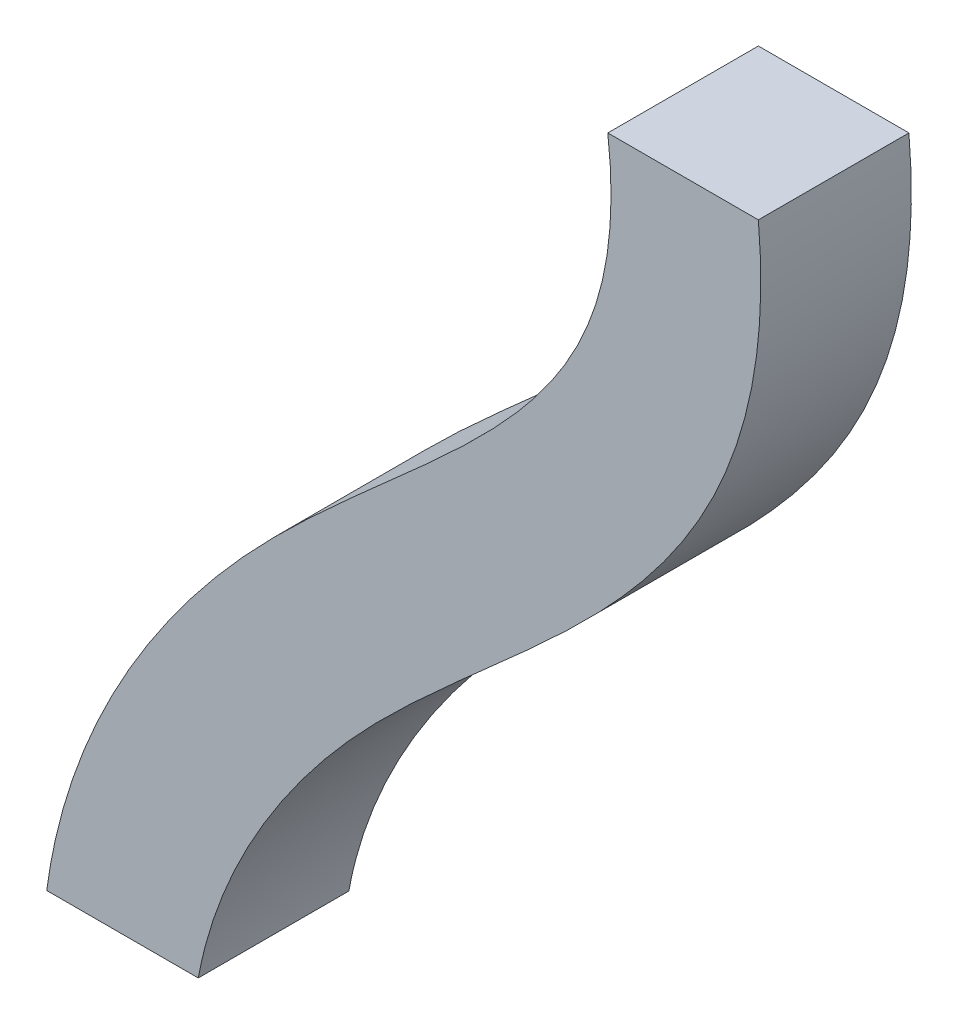
ISO-10303-21;
HEADER;
FILE_DESCRIPTION(('STEP AP214'),'2;1');
FILE_NAME('part.step','',(''),(''),'','','');
FILE_SCHEMA(('AUTOMOTIVE_DESIGN { 1 0 10303 214 1 1 1 1 }'));
ENDSEC;
DATA;
#1=APPLICATION_CONTEXT('core data for automotive mechanical design processes');
#2=APPLICATION_PROTOCOL_DEFINITION('international standard','automotive_design',2000,#1);
#3=PRODUCT_CONTEXT('',#1,'mechanical');
#4=PRODUCT('Part','Part','',(#3));
#5=PRODUCT_RELATED_PRODUCT_CATEGORY('part','',(#4));
#6=PRODUCT_DEFINITION_FORMATION('','',#4);
#7=PRODUCT_DEFINITION_CONTEXT('part definition',#1,'design');
#8=PRODUCT_DEFINITION('design','',#6,#7);
#9=PRODUCT_DEFINITION_SHAPE('','',#8);
#10=(LENGTH_UNIT() NAMED_UNIT(*) SI_UNIT(.MILLI.,.METRE.));
#11=(NAMED_UNIT(*) PLANE_ANGLE_UNIT() SI_UNIT($,.RADIAN.));
#12=(NAMED_UNIT(*) SI_UNIT($,.STERADIAN.) SOLID_ANGLE_UNIT());
#13=UNCERTAINTY_MEASURE_WITH_UNIT(LENGTH_MEASURE(1.E-05),#10,'distance_accuracy_value','');
#14=(GEOMETRIC_REPRESENTATION_CONTEXT(3) GLOBAL_UNCERTAINTY_ASSIGNED_CONTEXT((#13)) GLOBAL_UNIT_ASSIGNED_CONTEXT((#10,
#11,#12)) REPRESENTATION_CONTEXT('',''));
#15=CARTESIAN_POINT('',(0.,0.,0.));
#16=DIRECTION('',(0.,0.,1.));
#17=DIRECTION('',(1.,0.,0.));
#18=AXIS2_PLACEMENT_3D('',#15,#16,#17);
#19=CARTESIAN_POINT('',(0.,0.,0.));
#20=DIRECTION('',(0.,1.,0.));
#21=DIRECTION('',(0.,0.,1.));
#22=AXIS2_PLACEMENT_3D('',#19,#20,#21);
#23=PLANE('',#22);
#24=DIRECTION('',(0.,0.,-1.));
#25=VECTOR('',#24,1.);
#26=CARTESIAN_POINT('',(611.741772790014,0.,-39.5152745604033));
#27=LINE('',#26,#25);
#28=CARTESIAN_POINT('',(611.741772790014,0.,30.4847254395967));
#29=VERTEX_POINT('',#28);
#30=CARTESIAN_POINT('',(611.741772790014,0.,-39.5152745604033));
#31=VERTEX_POINT('',#30);
#32=EDGE_CURVE('E183',#29,#31,#27,.T.);
#33=ORIENTED_EDGE('',*,*,#32,.T.);
#34=DIRECTION('',(-1.,0.,0.));
#35=VECTOR('',#34,1.);
#36=CARTESIAN_POINT('',(541.741772790014,0.,-39.5152745604033));
#37=LINE('',#36,#35);
#38=CARTESIAN_POINT('',(541.741772790014,0.,-39.5152745604033));
#39=VERTEX_POINT('',#38);
#40=EDGE_CURVE('E128',#31,#39,#37,.T.);
#41=ORIENTED_EDGE('',*,*,#40,.T.);
#42=DIRECTION('',(0.,0.,1.));
#43=VECTOR('',#42,1.);
#44=CARTESIAN_POINT('',(541.741772790014,0.,-39.5152745604033));
#45=LINE('',#44,#43);
#46=CARTESIAN_POINT('',(541.741772790014,0.,30.4847254395967));
#47=VERTEX_POINT('',#46);
#48=EDGE_CURVE('E161',#39,#47,#45,.T.);
#49=ORIENTED_EDGE('',*,*,#48,.T.);
#50=DIRECTION('',(1.,0.,0.));
#51=VECTOR('',#50,1.);
#52=CARTESIAN_POINT('',(541.741772790014,0.,30.4847254395967));
#53=LINE('',#52,#51);
#54=EDGE_CURVE('E165',#47,#29,#53,.T.);
#55=ORIENTED_EDGE('',*,*,#54,.T.);
#56=EDGE_LOOP('',(#33,#41,#49,#55));
#57=FACE_BOUND('',#56,.T.);
#58=ADVANCED_FACE('F107',(#57),#23,.T.);
#59=CARTESIAN_POINT('',(541.741772790014,0.,-39.5152745604033));
#60=DIRECTION('',(0.,0.,1.));
#61=DIRECTION('',(1.,0.,0.));
#62=AXIS2_PLACEMENT_3D('',#59,#60,#61);
#63=PLANE('',#62);
#64=CARTESIAN_POINT('',(611.741772790014,0.,-39.5152745604033));
#65=CARTESIAN_POINT('',(613.562905224931,-20.0616472115125,-39.5152745604033));
#66=CARTESIAN_POINT('',(613.14048338357,-38.9738947204904,-39.5152745604033));
#67=CARTESIAN_POINT('',(608.227995639618,-74.4915853108754,-39.5152745604033));
#68=CARTESIAN_POINT('',(603.732053663311,-91.0823829022049,-39.5152745604033));
#69=CARTESIAN_POINT('',(591.56559202669,-121.802907269018,-39.5152745604033));
#70=CARTESIAN_POINT('',(583.914179699584,-135.921385392899,-39.5152745604033));
#71=CARTESIAN_POINT('',(566.634432131545,-161.975824337006,-39.5152745604033));
#72=CARTESIAN_POINT('',(557.014345366927,-173.923920184447,-39.5152745604033));
#73=CARTESIAN_POINT('',(536.758260824233,-196.324927260945,-39.5152745604033));
#74=CARTESIAN_POINT('',(526.117626198692,-206.785924758794,-39.5152745604033));
#75=CARTESIAN_POINT('',(504.521198396129,-226.919183017288,-39.5152745604033));
#76=CARTESIAN_POINT('',(493.561726757358,-236.592745768052,-39.5152745604033));
#77=CARTESIAN_POINT('',(471.934149289734,-255.741582394168,-39.5152745604033));
#78=CARTESIAN_POINT('',(461.265673609003,-265.216217079208,-39.5152745604033));
#79=CARTESIAN_POINT('',(440.796524994402,-284.446980973058,-39.5152745604033));
#80=CARTESIAN_POINT('',(430.99774047155,-294.201320957036,-39.5152745604033));
#81=CARTESIAN_POINT('',(410.786079495008,-316.615605120434,-39.5152745604033));
#82=CARTESIAN_POINT('',(400.438823277183,-329.681936911015,-39.5152745604033));
#83=CARTESIAN_POINT('',(382.067591566884,-356.794632727111,-39.5152745604033));
#84=CARTESIAN_POINT('',(374.045977448551,-370.839740148192,-39.5152745604033));
#85=CARTESIAN_POINT('',(361.025054863116,-399.351363376407,-39.5152745604033));
#86=CARTESIAN_POINT('',(356.028025299877,-413.811599267277,-39.5152745604033));
#87=CARTESIAN_POINT('',(349.565825431464,-442.653097808242,-39.5152745604033));
#88=CARTESIAN_POINT('',(348.093872619243,-457.031282950129,-39.5152745604033));
#89=CARTESIAN_POINT('',(348.561130912325,-471.2706044472,-39.5152745604033));
#90=B_SPLINE_CURVE_WITH_KNOTS('',3,(#64,#65,#66,#67,#68,#69,#70,#71,#72,#73,#74,#75,#76,#77,#78,
#79,#80,#81,#82,#83,#84,#85,#86,#87,#88,#89),.UNSPECIFIED.,.F.,.F.,(4,2,2,2,2,2,2,2,2,2,2,2,4),
(0.,0.077645881562616,0.155291763125232,0.232937644687848,0.310583526250464,0.38822940781308,
0.465875289375696,0.543521170938312,0.621167052500928,0.715875289375696,0.810583526250464,
0.905291763125232,1.),.UNSPECIFIED.);
#91=CARTESIAN_POINT('',(351.319279962393,-435.49074481,-39.5152745604033));
#92=VERTEX_POINT('',#91);
#93=EDGE_CURVE('E114',#31,#92,#90,.T.);
#94=ORIENTED_EDGE('',*,*,#93,.T.);
#95=DIRECTION('',(-1.,0.,0.));
#96=VECTOR('',#95,1.);
#97=CARTESIAN_POINT('',(541.741772790014,-435.49074481,-39.5152745604033));
#98=LINE('',#97,#96);
#99=CARTESIAN_POINT('',(280.869379601787,-435.49074481,-39.5152745604033));
#100=VERTEX_POINT('',#99);
#101=EDGE_CURVE('E12',#92,#100,#98,.T.);
#102=ORIENTED_EDGE('',*,*,#101,.T.);
#103=CARTESIAN_POINT('',(541.741772790014,0.,-39.5152745604033));
#104=CARTESIAN_POINT('',(543.56415219468,-15.2695281822962,-39.5152745604033));
#105=CARTESIAN_POINT('',(543.658240209991,-28.8208110597561,-39.5152745604033));
#106=CARTESIAN_POINT('',(541.217260508264,-53.5051944505225,-39.5152745604033));
#107=CARTESIAN_POINT('',(538.687917708012,-64.6531188004586,-39.5152745604033));
#108=CARTESIAN_POINT('',(531.352692176673,-85.6967815401575,-39.5152745604033));
#109=CARTESIAN_POINT('',(526.527702123521,-95.6037685769043,-39.5152745604033));
#110=CARTESIAN_POINT('',(514.649511843315,-114.898376479927,-39.5152745604033));
#111=CARTESIAN_POINT('',(507.588063148169,-124.273862323525,-39.5152745604033));
#112=CARTESIAN_POINT('',(491.521928210125,-142.829508473568,-39.5152745604033));
#113=CARTESIAN_POINT('',(482.521878819536,-152.001582508548,-39.5152745604033));
#114=CARTESIAN_POINT('',(463.123774552974,-170.455330470608,-39.5152745604033));
#115=CARTESIAN_POINT('',(452.729398141779,-179.735702409078,-39.5152745604033));
#116=CARTESIAN_POINT('',(431.182100000906,-198.826971629846,-39.5152745604033));
#117=CARTESIAN_POINT('',(420.029548121204,-208.638508101048,-39.5152745604033));
#118=CARTESIAN_POINT('',(397.635446630355,-229.323696303041,-39.5152745604033));
#119=CARTESIAN_POINT('',(386.392008605601,-240.199137255719,-39.5152745604033));
#120=CARTESIAN_POINT('',(362.142543770764,-266.191454307545,-39.5152745604033));
#121=CARTESIAN_POINT('',(349.564722419384,-281.476299366304,-39.5152745604033));
#122=CARTESIAN_POINT('',(326.690089810556,-313.837794757334,-39.5152745604033));
#123=CARTESIAN_POINT('',(316.390917174395,-330.915701706901,-39.5152745604033));
#124=CARTESIAN_POINT('',(298.966406942779,-366.690086013992,-39.5152745604033));
#125=CARTESIAN_POINT('',(291.83879044129,-385.392843292034,-39.5152745604033));
#126=CARTESIAN_POINT('',(281.839688743101,-424.185451174305,-39.5152745604033));
#127=CARTESIAN_POINT('',(278.975285414118,-444.278374115223,-39.5152745604033));
#128=CARTESIAN_POINT('',(278.860992480089,-464.798301725059,-39.5152745604033));
#129=B_SPLINE_CURVE_WITH_KNOTS('',3,(#103,#104,#105,#106,#107,#108,#109,#110,#111,#112,#113,
#114,#115,#116,#117,#118,#119,#120,#121,#122,#123,#124,#125,#126,#127,#128),.UNSPECIFIED.,.F.,
.F.,(4,2,2,2,2,2,2,2,2,2,2,2,4),(0.,0.077645881562616,0.155291763125232,0.232937644687848,
0.310583526250464,0.38822940781308,0.465875289375696,0.543521170938312,0.621167052500928,
0.715875289375696,0.810583526250464,0.905291763125232,1.),.UNSPECIFIED.);
#130=EDGE_CURVE('E160',#39,#100,#129,.T.);
#131=ORIENTED_EDGE('',*,*,#130,.F.);
#132=ORIENTED_EDGE('',*,*,#40,.F.);
#133=EDGE_LOOP('',(#94,#102,#131,#132));
#134=FACE_BOUND('',#133,.T.);
#135=ADVANCED_FACE('F198',(#134),#63,.F.);
#136=CARTESIAN_POINT('',(611.741772790014,0.,30.4847254395967));
#137=CARTESIAN_POINT('',(613.562905224931,-20.0616472115125,30.4847254395967));
#138=CARTESIAN_POINT('',(613.14048338357,-38.9738947204904,30.4847254395967));
#139=CARTESIAN_POINT('',(608.227995639618,-74.4915853108754,30.4847254395967));
#140=CARTESIAN_POINT('',(603.732053663311,-91.0823829022049,30.4847254395967));
#141=CARTESIAN_POINT('',(591.56559202669,-121.802907269018,30.4847254395967));
#142=CARTESIAN_POINT('',(583.914179699584,-135.921385392899,30.4847254395967));
#143=CARTESIAN_POINT('',(566.634432131545,-161.975824337006,30.4847254395967));
#144=CARTESIAN_POINT('',(557.014345366927,-173.923920184447,30.4847254395967));
#145=CARTESIAN_POINT('',(536.758260824233,-196.324927260945,30.4847254395967));
#146=CARTESIAN_POINT('',(526.117626198692,-206.785924758794,30.4847254395967));
#147=CARTESIAN_POINT('',(504.521198396129,-226.919183017288,30.4847254395967));
#148=CARTESIAN_POINT('',(493.561726757358,-236.592745768052,30.4847254395967));
#149=CARTESIAN_POINT('',(471.934149289734,-255.741582394168,30.4847254395967));
#150=CARTESIAN_POINT('',(461.265673609003,-265.216217079208,30.4847254395967));
#151=CARTESIAN_POINT('',(440.796524994402,-284.446980973058,30.4847254395967));
#152=CARTESIAN_POINT('',(430.99774047155,-294.201320957036,30.4847254395967));
#153=CARTESIAN_POINT('',(410.786079495008,-316.615605120434,30.4847254395967));
#154=CARTESIAN_POINT('',(400.438823277183,-329.681936911015,30.4847254395967));
#155=CARTESIAN_POINT('',(382.067591566884,-356.794632727111,30.4847254395967));
#156=CARTESIAN_POINT('',(374.045977448551,-370.839740148192,30.4847254395967));
#157=CARTESIAN_POINT('',(361.025054863116,-399.351363376407,30.4847254395967));
#158=CARTESIAN_POINT('',(356.028025299877,-413.811599267277,30.4847254395967));
#159=CARTESIAN_POINT('',(349.565825431464,-442.653097808242,30.4847254395967));
#160=CARTESIAN_POINT('',(348.093872619243,-457.031282950129,30.4847254395967));
#161=CARTESIAN_POINT('',(348.561130912325,-471.2706044472,30.4847254395967));
#162=CARTESIAN_POINT('',(611.741772790014,0.,-39.5152745604033));
#163=CARTESIAN_POINT('',(613.562905224931,-20.0616472115125,-39.5152745604033));
#164=CARTESIAN_POINT('',(613.14048338357,-38.9738947204904,-39.5152745604033));
#165=CARTESIAN_POINT('',(608.227995639618,-74.4915853108754,-39.5152745604033));
#166=CARTESIAN_POINT('',(603.732053663311,-91.0823829022049,-39.5152745604033));
#167=CARTESIAN_POINT('',(591.56559202669,-121.802907269018,-39.5152745604033));
#168=CARTESIAN_POINT('',(583.914179699584,-135.921385392899,-39.5152745604033));
#169=CARTESIAN_POINT('',(566.634432131545,-161.975824337006,-39.5152745604033));
#170=CARTESIAN_POINT('',(557.014345366927,-173.923920184447,-39.5152745604033));
#171=CARTESIAN_POINT('',(536.758260824233,-196.324927260945,-39.5152745604033));
#172=CARTESIAN_POINT('',(526.117626198692,-206.785924758794,-39.5152745604033));
#173=CARTESIAN_POINT('',(504.521198396129,-226.919183017288,-39.5152745604033));
#174=CARTESIAN_POINT('',(493.561726757358,-236.592745768052,-39.5152745604033));
#175=CARTESIAN_POINT('',(471.934149289734,-255.741582394168,-39.5152745604033));
#176=CARTESIAN_POINT('',(461.265673609003,-265.216217079208,-39.5152745604033));
#177=CARTESIAN_POINT('',(440.796524994402,-284.446980973058,-39.5152745604033));
#178=CARTESIAN_POINT('',(430.99774047155,-294.201320957036,-39.5152745604033));
#179=CARTESIAN_POINT('',(410.786079495008,-316.615605120434,-39.5152745604033));
#180=CARTESIAN_POINT('',(400.438823277183,-329.681936911015,-39.5152745604033));
#181=CARTESIAN_POINT('',(382.067591566884,-356.794632727111,-39.5152745604033));
#182=CARTESIAN_POINT('',(374.045977448551,-370.839740148192,-39.5152745604033));
#183=CARTESIAN_POINT('',(361.025054863116,-399.351363376407,-39.5152745604033));
#184=CARTESIAN_POINT('',(356.028025299877,-413.811599267277,-39.5152745604033));
#185=CARTESIAN_POINT('',(349.565825431464,-442.653097808242,-39.5152745604033));
#186=CARTESIAN_POINT('',(348.093872619243,-457.031282950129,-39.5152745604033));
#187=CARTESIAN_POINT('',(348.561130912325,-471.2706044472,-39.5152745604033));
#188=B_SPLINE_SURFACE_WITH_KNOTS('',1,3,((#136,#137,#138,#139,#140,#141,#142,#143,#144,#145,
#146,#147,#148,#149,#150,#151,#152,#153,#154,#155,#156,#157,#158,#159,#160,#161),(#162,#163,
#164,#165,#166,#167,#168,#169,#170,#171,#172,#173,#174,#175,#176,#177,#178,#179,#180,#181,#182,
#183,#184,#185,#186,#187)),.UNSPECIFIED.,.F.,.F.,.F.,(2,2),(4,2,2,2,2,2,2,2,2,2,2,2,4),(0.,1.),
(0.,0.077645881562616,0.155291763125232,0.232937644687848,0.310583526250464,0.38822940781308,
0.465875289375696,0.543521170938312,0.621167052500928,0.715875289375696,0.810583526250464,
0.905291763125232,1.),.UNSPECIFIED.);
#189=CARTESIAN_POINT('',(611.741772790014,0.,30.4847254395967));
#190=CARTESIAN_POINT('',(613.562905224931,-20.0616472115125,30.4847254395967));
#191=CARTESIAN_POINT('',(613.14048338357,-38.9738947204904,30.4847254395967));
#192=CARTESIAN_POINT('',(608.227995639618,-74.4915853108754,30.4847254395967));
#193=CARTESIAN_POINT('',(603.732053663311,-91.0823829022049,30.4847254395967));
#194=CARTESIAN_POINT('',(591.56559202669,-121.802907269018,30.4847254395967));
#195=CARTESIAN_POINT('',(583.914179699584,-135.921385392899,30.4847254395967));
#196=CARTESIAN_POINT('',(566.634432131545,-161.975824337006,30.4847254395967));
#197=CARTESIAN_POINT('',(557.014345366927,-173.923920184447,30.4847254395967));
#198=CARTESIAN_POINT('',(536.758260824233,-196.324927260945,30.4847254395967));
#199=CARTESIAN_POINT('',(526.117626198692,-206.785924758794,30.4847254395967));
#200=CARTESIAN_POINT('',(504.521198396129,-226.919183017288,30.4847254395967));
#201=CARTESIAN_POINT('',(493.561726757358,-236.592745768052,30.4847254395967));
#202=CARTESIAN_POINT('',(471.934149289734,-255.741582394168,30.4847254395967));
#203=CARTESIAN_POINT('',(461.265673609003,-265.216217079208,30.4847254395967));
#204=CARTESIAN_POINT('',(440.796524994402,-284.446980973058,30.4847254395967));
#205=CARTESIAN_POINT('',(430.99774047155,-294.201320957036,30.4847254395967));
#206=CARTESIAN_POINT('',(410.786079495008,-316.615605120434,30.4847254395967));
#207=CARTESIAN_POINT('',(400.438823277183,-329.681936911015,30.4847254395967));
#208=CARTESIAN_POINT('',(382.067591566884,-356.794632727111,30.4847254395967));
#209=CARTESIAN_POINT('',(374.045977448551,-370.839740148192,30.4847254395967));
#210=CARTESIAN_POINT('',(361.025054863116,-399.351363376407,30.4847254395967));
#211=CARTESIAN_POINT('',(356.028025299877,-413.811599267277,30.4847254395967));
#212=CARTESIAN_POINT('',(349.565825431464,-442.653097808242,30.4847254395967));
#213=CARTESIAN_POINT('',(348.093872619243,-457.031282950129,30.4847254395967));
#214=CARTESIAN_POINT('',(348.561130912325,-471.2706044472,30.4847254395967));
#215=B_SPLINE_CURVE_WITH_KNOTS('',3,(#189,#190,#191,#192,#193,#194,#195,#196,#197,#198,#199,
#200,#201,#202,#203,#204,#205,#206,#207,#208,#209,#210,#211,#212,#213,#214),.UNSPECIFIED.,.F.,
.F.,(4,2,2,2,2,2,2,2,2,2,2,2,4),(0.,0.077645881562616,0.155291763125232,0.232937644687848,
0.310583526250464,0.38822940781308,0.465875289375696,0.543521170938312,0.621167052500928,
0.715875289375696,0.810583526250464,0.905291763125232,1.),.UNSPECIFIED.);
#216=CARTESIAN_POINT('',(351.319279963788,-435.49074481,30.4847254395967));
#217=VERTEX_POINT('',#216);
#218=EDGE_CURVE('E167',#29,#217,#215,.T.);
#219=DIRECTION('',(0.,0.,-1.));
#220=VECTOR('',#219,1.);
#221=CARTESIAN_POINT('',(351.319279963788,-435.490744810003,-4.51527456040332));
#222=LINE('',#221,#220);
#223=EDGE_CURVE('E149',#217,#92,#222,.T.);
#224=ORIENTED_EDGE('',*,*,#218,.T.);
#225=ORIENTED_EDGE('',*,*,#223,.T.);
#226=ORIENTED_EDGE('',*,*,#93,.F.);
#227=ORIENTED_EDGE('',*,*,#32,.F.);
#228=EDGE_LOOP('',(#224,#225,#226,#227));
#229=FACE_BOUND('',#228,.T.);
#230=ADVANCED_FACE('F200',(#229),#188,.F.);
#231=CARTESIAN_POINT('',(541.741772790014,0.,30.4847254395967));
#232=DIRECTION('',(0.,0.,1.));
#233=DIRECTION('',(1.,0.,0.));
#234=AXIS2_PLACEMENT_3D('',#231,#232,#233);
#235=PLANE('',#234);
#236=CARTESIAN_POINT('',(541.741772790014,0.,30.4847254395967));
#237=CARTESIAN_POINT('',(543.56415219468,-15.2695281822962,30.4847254395967));
#238=CARTESIAN_POINT('',(543.658240209991,-28.8208110597561,30.4847254395967));
#239=CARTESIAN_POINT('',(541.217260508264,-53.5051944505225,30.4847254395967));
#240=CARTESIAN_POINT('',(538.687917708012,-64.6531188004586,30.4847254395967));
#241=CARTESIAN_POINT('',(531.352692176673,-85.6967815401575,30.4847254395967));
#242=CARTESIAN_POINT('',(526.527702123521,-95.6037685769043,30.4847254395967));
#243=CARTESIAN_POINT('',(514.649511843315,-114.898376479927,30.4847254395967));
#244=CARTESIAN_POINT('',(507.588063148169,-124.273862323525,30.4847254395967));
#245=CARTESIAN_POINT('',(491.521928210125,-142.829508473568,30.4847254395967));
#246=CARTESIAN_POINT('',(482.521878819536,-152.001582508548,30.4847254395967));
#247=CARTESIAN_POINT('',(463.123774552974,-170.455330470608,30.4847254395967));
#248=CARTESIAN_POINT('',(452.729398141779,-179.735702409078,30.4847254395967));
#249=CARTESIAN_POINT('',(431.182100000906,-198.826971629846,30.4847254395967));
#250=CARTESIAN_POINT('',(420.029548121204,-208.638508101048,30.4847254395967));
#251=CARTESIAN_POINT('',(397.635446630355,-229.323696303041,30.4847254395967));
#252=CARTESIAN_POINT('',(386.392008605601,-240.199137255719,30.4847254395967));
#253=CARTESIAN_POINT('',(362.142543770764,-266.191454307545,30.4847254395967));
#254=CARTESIAN_POINT('',(349.564722419384,-281.476299366304,30.4847254395967));
#255=CARTESIAN_POINT('',(326.690089810556,-313.837794757334,30.4847254395967));
#256=CARTESIAN_POINT('',(316.390917174395,-330.915701706901,30.4847254395967));
#257=CARTESIAN_POINT('',(298.966406942779,-366.690086013992,30.4847254395967));
#258=CARTESIAN_POINT('',(291.83879044129,-385.392843292034,30.4847254395967));
#259=CARTESIAN_POINT('',(281.839688743101,-424.185451174305,30.4847254395967));
#260=CARTESIAN_POINT('',(278.975285414118,-444.278374115223,30.4847254395967));
#261=CARTESIAN_POINT('',(278.860992480089,-464.798301725059,30.4847254395967));
#262=B_SPLINE_CURVE_WITH_KNOTS('',3,(#236,#237,#238,#239,#240,#241,#242,#243,#244,#245,#246,
#247,#248,#249,#250,#251,#252,#253,#254,#255,#256,#257,#258,#259,#260,#261),.UNSPECIFIED.,.F.,
.F.,(4,2,2,2,2,2,2,2,2,2,2,2,4),(0.,0.077645881562616,0.155291763125232,0.232937644687848,
0.310583526250464,0.38822940781308,0.465875289375696,0.543521170938312,0.621167052500928,
0.715875289375696,0.810583526250464,0.905291763125232,1.),.UNSPECIFIED.);
#263=CARTESIAN_POINT('',(280.869379601787,-435.49074481,30.4847254395967));
#264=VERTEX_POINT('',#263);
#265=EDGE_CURVE('E159',#47,#264,#262,.T.);
#266=ORIENTED_EDGE('',*,*,#265,.T.);
#267=DIRECTION('',(1.,0.,0.));
#268=VECTOR('',#267,1.);
#269=CARTESIAN_POINT('',(198.841154809304,-435.49074481,30.4847254395967));
#270=LINE('',#269,#268);
#271=EDGE_CURVE('E146',#264,#217,#270,.T.);
#272=ORIENTED_EDGE('',*,*,#271,.T.);
#273=ORIENTED_EDGE('',*,*,#218,.F.);
#274=ORIENTED_EDGE('',*,*,#54,.F.);
#275=EDGE_LOOP('',(#266,#272,#273,#274));
#276=FACE_BOUND('',#275,.T.);
#277=ADVANCED_FACE('F163',(#276),#235,.T.);
#278=CARTESIAN_POINT('',(541.741772790014,0.,-39.5152745604033));
#279=CARTESIAN_POINT('',(543.56415219468,-15.2695281822962,-39.5152745604033));
#280=CARTESIAN_POINT('',(543.658240209991,-28.8208110597561,-39.5152745604033));
#281=CARTESIAN_POINT('',(541.217260508264,-53.5051944505225,-39.5152745604033));
#282=CARTESIAN_POINT('',(538.687917708012,-64.6531188004586,-39.5152745604033));
#283=CARTESIAN_POINT('',(531.352692176673,-85.6967815401575,-39.5152745604033));
#284=CARTESIAN_POINT('',(526.527702123521,-95.6037685769043,-39.5152745604033));
#285=CARTESIAN_POINT('',(514.649511843315,-114.898376479927,-39.5152745604033));
#286=CARTESIAN_POINT('',(507.588063148169,-124.273862323525,-39.5152745604033));
#287=CARTESIAN_POINT('',(491.521928210125,-142.829508473568,-39.5152745604033));
#288=CARTESIAN_POINT('',(482.521878819536,-152.001582508548,-39.5152745604033));
#289=CARTESIAN_POINT('',(463.123774552974,-170.455330470608,-39.5152745604033));
#290=CARTESIAN_POINT('',(452.729398141779,-179.735702409078,-39.5152745604033));
#291=CARTESIAN_POINT('',(431.182100000906,-198.826971629846,-39.5152745604033));
#292=CARTESIAN_POINT('',(420.029548121204,-208.638508101048,-39.5152745604033));
#293=CARTESIAN_POINT('',(397.635446630355,-229.323696303041,-39.5152745604033));
#294=CARTESIAN_POINT('',(386.392008605601,-240.199137255719,-39.5152745604033));
#295=CARTESIAN_POINT('',(362.142543770764,-266.191454307545,-39.5152745604033));
#296=CARTESIAN_POINT('',(349.564722419384,-281.476299366304,-39.5152745604033));
#297=CARTESIAN_POINT('',(326.690089810556,-313.837794757334,-39.5152745604033));
#298=CARTESIAN_POINT('',(316.390917174395,-330.915701706901,-39.5152745604033));
#299=CARTESIAN_POINT('',(298.966406942779,-366.690086013992,-39.5152745604033));
#300=CARTESIAN_POINT('',(291.83879044129,-385.392843292034,-39.5152745604033));
#301=CARTESIAN_POINT('',(281.839688743101,-424.185451174305,-39.5152745604033));
#302=CARTESIAN_POINT('',(278.975285414118,-444.278374115223,-39.5152745604033));
#303=CARTESIAN_POINT('',(278.860992480089,-464.798301725059,-39.5152745604033));
#304=CARTESIAN_POINT('',(541.741772790014,0.,30.4847254395967));
#305=CARTESIAN_POINT('',(543.56415219468,-15.2695281822962,30.4847254395967));
#306=CARTESIAN_POINT('',(543.658240209991,-28.8208110597561,30.4847254395967));
#307=CARTESIAN_POINT('',(541.217260508264,-53.5051944505225,30.4847254395967));
#308=CARTESIAN_POINT('',(538.687917708012,-64.6531188004586,30.4847254395967));
#309=CARTESIAN_POINT('',(531.352692176673,-85.6967815401575,30.4847254395967));
#310=CARTESIAN_POINT('',(526.527702123521,-95.6037685769043,30.4847254395967));
#311=CARTESIAN_POINT('',(514.649511843315,-114.898376479927,30.4847254395967));
#312=CARTESIAN_POINT('',(507.588063148169,-124.273862323525,30.4847254395967));
#313=CARTESIAN_POINT('',(491.521928210125,-142.829508473568,30.4847254395967));
#314=CARTESIAN_POINT('',(482.521878819536,-152.001582508548,30.4847254395967));
#315=CARTESIAN_POINT('',(463.123774552974,-170.455330470608,30.4847254395967));
#316=CARTESIAN_POINT('',(452.729398141779,-179.735702409078,30.4847254395967));
#317=CARTESIAN_POINT('',(431.182100000906,-198.826971629846,30.4847254395967));
#318=CARTESIAN_POINT('',(420.029548121204,-208.638508101048,30.4847254395967));
#319=CARTESIAN_POINT('',(397.635446630355,-229.323696303041,30.4847254395967));
#320=CARTESIAN_POINT('',(386.392008605601,-240.199137255719,30.4847254395967));
#321=CARTESIAN_POINT('',(362.142543770764,-266.191454307545,30.4847254395967));
#322=CARTESIAN_POINT('',(349.564722419384,-281.476299366304,30.4847254395967));
#323=CARTESIAN_POINT('',(326.690089810556,-313.837794757334,30.4847254395967));
#324=CARTESIAN_POINT('',(316.390917174395,-330.915701706901,30.4847254395967));
#325=CARTESIAN_POINT('',(298.966406942779,-366.690086013992,30.4847254395967));
#326=CARTESIAN_POINT('',(291.83879044129,-385.392843292034,30.4847254395967));
#327=CARTESIAN_POINT('',(281.839688743101,-424.185451174305,30.4847254395967));
#328=CARTESIAN_POINT('',(278.975285414118,-444.278374115223,30.4847254395967));
#329=CARTESIAN_POINT('',(278.860992480089,-464.798301725059,30.4847254395967));
#330=B_SPLINE_SURFACE_WITH_KNOTS('',1,3,((#278,#279,#280,#281,#282,#283,#284,#285,#286,#287,
#288,#289,#290,#291,#292,#293,#294,#295,#296,#297,#298,#299,#300,#301,#302,#303),(#304,#305,
#306,#307,#308,#309,#310,#311,#312,#313,#314,#315,#316,#317,#318,#319,#320,#321,#322,#323,#324,
#325,#326,#327,#328,#329)),.UNSPECIFIED.,.F.,.F.,.F.,(2,2),(4,2,2,2,2,2,2,2,2,2,2,2,4),(0.,1.),
(0.,0.077645881562616,0.155291763125232,0.232937644687848,0.310583526250464,0.38822940781308,
0.465875289375696,0.543521170938312,0.621167052500928,0.715875289375696,0.810583526250464,
0.905291763125232,1.),.UNSPECIFIED.);
#331=DIRECTION('',(0.,0.,1.));
#332=VECTOR('',#331,1.);
#333=CARTESIAN_POINT('',(280.869379601787,-435.49074481,-4.51527456040332));
#334=LINE('',#333,#332);
#335=EDGE_CURVE('E121',#100,#264,#334,.T.);
#336=ORIENTED_EDGE('',*,*,#130,.T.);
#337=ORIENTED_EDGE('',*,*,#335,.T.);
#338=ORIENTED_EDGE('',*,*,#265,.F.);
#339=ORIENTED_EDGE('',*,*,#48,.F.);
#340=EDGE_LOOP('',(#336,#337,#338,#339));
#341=FACE_BOUND('',#340,.T.);
#342=ADVANCED_FACE('F158',(#341),#330,.F.);
#343=CARTESIAN_POINT('',(198.841154809304,-435.49074481,30.4847254395967));
#344=DIRECTION('',(0.,1.,0.));
#345=DIRECTION('',(0.,0.,1.));
#346=AXIS2_PLACEMENT_3D('',#343,#344,#345);
#347=PLANE('',#346);
#348=ORIENTED_EDGE('',*,*,#101,.F.);
#349=ORIENTED_EDGE('',*,*,#223,.F.);
#350=ORIENTED_EDGE('',*,*,#271,.F.);
#351=ORIENTED_EDGE('',*,*,#335,.F.);
#352=EDGE_LOOP('',(#348,#349,#350,#351));
#353=FACE_BOUND('',#352,.T.);
#354=ADVANCED_FACE('F147',(#353),#347,.F.);
#355=CLOSED_SHELL('',(#58,#135,#230,#277,#342,#354));
#356=MANIFOLD_SOLID_BREP('B2',#355);
#357=ADVANCED_BREP_SHAPE_REPRESENTATION('',(#18,#356),#14);
#358=SHAPE_DEFINITION_REPRESENTATION(#9,#357);
ENDSEC;
END-ISO-10303-21;
